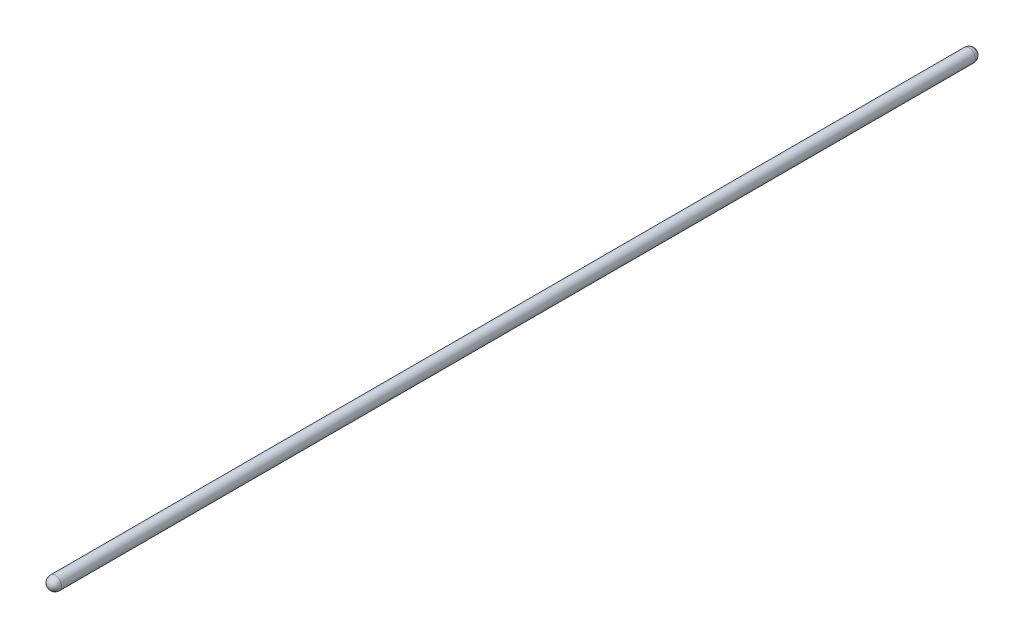
ISO-10303-21;
HEADER;
FILE_DESCRIPTION(('STEP AP214'),'2;1');
FILE_NAME('part.step','',(''),(''),'','','');
FILE_SCHEMA(('AUTOMOTIVE_DESIGN { 1 0 10303 214 1 1 1 1 }'));
ENDSEC;
DATA;
#1=APPLICATION_CONTEXT('core data for automotive mechanical design processes');
#2=APPLICATION_PROTOCOL_DEFINITION('international standard','automotive_design',2000,#1);
#3=PRODUCT_CONTEXT('',#1,'mechanical');
#4=PRODUCT('Part','Part','',(#3));
#5=PRODUCT_RELATED_PRODUCT_CATEGORY('part','',(#4));
#6=PRODUCT_DEFINITION_FORMATION('','',#4);
#7=PRODUCT_DEFINITION_CONTEXT('part definition',#1,'design');
#8=PRODUCT_DEFINITION('design','',#6,#7);
#9=PRODUCT_DEFINITION_SHAPE('','',#8);
#10=(LENGTH_UNIT() NAMED_UNIT(*) SI_UNIT(.MILLI.,.METRE.));
#11=(NAMED_UNIT(*) PLANE_ANGLE_UNIT() SI_UNIT($,.RADIAN.));
#12=(NAMED_UNIT(*) SI_UNIT($,.STERADIAN.) SOLID_ANGLE_UNIT());
#13=UNCERTAINTY_MEASURE_WITH_UNIT(LENGTH_MEASURE(1.E-05),#10,'distance_accuracy_value','');
#14=(GEOMETRIC_REPRESENTATION_CONTEXT(3) GLOBAL_UNCERTAINTY_ASSIGNED_CONTEXT((#13)) GLOBAL_UNIT_ASSIGNED_CONTEXT((#10,
#11,#12)) REPRESENTATION_CONTEXT('',''));
#15=CARTESIAN_POINT('',(0.,0.,0.));
#16=DIRECTION('',(0.,0.,1.));
#17=DIRECTION('',(1.,0.,0.));
#18=AXIS2_PLACEMENT_3D('',#15,#16,#17);
#19=CARTESIAN_POINT('',(0.,0.,0.));
#20=DIRECTION('',(0.,0.,-1.));
#21=DIRECTION('',(1.,0.,0.));
#22=AXIS2_PLACEMENT_3D('',#19,#20,#21);
#23=SPHERICAL_SURFACE('',#22,9.525);
#24=CARTESIAN_POINT('',(0.,0.,0.));
#25=DIRECTION('',(0.,0.,-1.));
#26=DIRECTION('',(-1.,0.,0.));
#27=AXIS2_PLACEMENT_3D('',#24,#25,#26);
#28=CIRCLE('',#27,9.525);
#29=CARTESIAN_POINT('',(-9.525,0.,0.));
#30=VERTEX_POINT('',#29);
#31=EDGE_CURVE('E10',#30,#30,#28,.T.);
#32=ORIENTED_EDGE('',*,*,#31,.T.);
#33=EDGE_LOOP('',(#32));
#34=FACE_BOUND('',#33,.T.);
#35=ADVANCED_FACE('F31',(#34),#23,.T.);
#36=CARTESIAN_POINT('',(0.,0.,-9.525));
#37=DIRECTION('',(0.,0.,-1.));
#38=DIRECTION('',(-1.,0.,0.));
#39=AXIS2_PLACEMENT_3D('',#36,#37,#38);
#40=CYLINDRICAL_SURFACE('',#39,9.52500000000001);
#41=ORIENTED_EDGE('',*,*,#31,.F.);
#42=EDGE_LOOP('',(#41));
#43=FACE_BOUND('',#42,.T.);
#44=CARTESIAN_POINT('',(1.66046065295677E-13,0.,1346.344018));
#45=DIRECTION('',(0.,0.,-1.));
#46=DIRECTION('',(-1.,0.,0.));
#47=AXIS2_PLACEMENT_3D('',#44,#45,#46);
#48=CIRCLE('',#47,9.52500000000003);
#49=CARTESIAN_POINT('',(-9.52499999999986,0.,1346.344018));
#50=VERTEX_POINT('',#49);
#51=EDGE_CURVE('E37',#50,#50,#48,.T.);
#52=ORIENTED_EDGE('',*,*,#51,.T.);
#53=EDGE_LOOP('',(#52));
#54=FACE_BOUND('',#53,.T.);
#55=ADVANCED_FACE('F43',(#43,#54),#40,.T.);
#56=CARTESIAN_POINT('',(0.,0.,1346.344018));
#57=DIRECTION('',(0.,0.,-1.));
#58=DIRECTION('',(1.,0.,0.));
#59=AXIS2_PLACEMENT_3D('',#56,#57,#58);
#60=SPHERICAL_SURFACE('',#59,9.5250000000002);
#61=ORIENTED_EDGE('',*,*,#51,.F.);
#62=EDGE_LOOP('',(#61));
#63=FACE_BOUND('',#62,.T.);
#64=ADVANCED_FACE('F45',(#63),#60,.T.);
#65=CLOSED_SHELL('',(#35,#55,#64));
#66=MANIFOLD_SOLID_BREP('B2',#65);
#67=ADVANCED_BREP_SHAPE_REPRESENTATION('',(#18,#66),#14);
#68=SHAPE_DEFINITION_REPRESENTATION(#9,#67);
ENDSEC;
END-ISO-10303-21;
